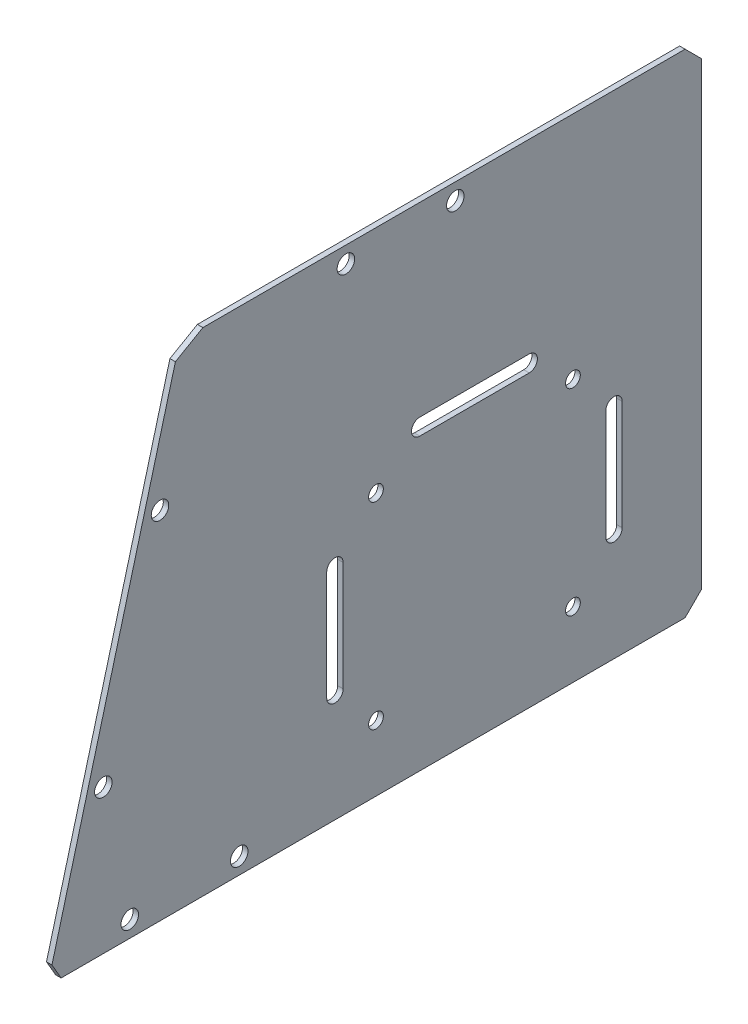
ISO-10303-21;
HEADER;
FILE_DESCRIPTION(('STEP AP214'),'2;1');
FILE_NAME('part.step','',(''),(''),'','','');
FILE_SCHEMA(('AUTOMOTIVE_DESIGN { 1 0 10303 214 1 1 1 1 }'));
ENDSEC;
DATA;
#1=APPLICATION_CONTEXT('core data for automotive mechanical design processes');
#2=APPLICATION_PROTOCOL_DEFINITION('international standard','automotive_design',2000,#1);
#3=PRODUCT_CONTEXT('',#1,'mechanical');
#4=PRODUCT('Part','Part','',(#3));
#5=PRODUCT_RELATED_PRODUCT_CATEGORY('part','',(#4));
#6=PRODUCT_DEFINITION_FORMATION('','',#4);
#7=PRODUCT_DEFINITION_CONTEXT('part definition',#1,'design');
#8=PRODUCT_DEFINITION('design','',#6,#7);
#9=PRODUCT_DEFINITION_SHAPE('','',#8);
#10=(LENGTH_UNIT() NAMED_UNIT(*) SI_UNIT(.MILLI.,.METRE.));
#11=(NAMED_UNIT(*) PLANE_ANGLE_UNIT() SI_UNIT($,.RADIAN.));
#12=(NAMED_UNIT(*) SI_UNIT($,.STERADIAN.) SOLID_ANGLE_UNIT());
#13=UNCERTAINTY_MEASURE_WITH_UNIT(LENGTH_MEASURE(1.E-05),#10,'distance_accuracy_value','');
#14=(GEOMETRIC_REPRESENTATION_CONTEXT(3) GLOBAL_UNCERTAINTY_ASSIGNED_CONTEXT((#13)) GLOBAL_UNIT_ASSIGNED_CONTEXT((#10,
#11,#12)) REPRESENTATION_CONTEXT('',''));
#15=CARTESIAN_POINT('',(0.,0.,0.));
#16=DIRECTION('',(0.,0.,1.));
#17=DIRECTION('',(1.,0.,0.));
#18=AXIS2_PLACEMENT_3D('',#15,#16,#17);
#19=CARTESIAN_POINT('',(1.,0.,0.));
#20=DIRECTION('',(1.,0.,0.));
#21=DIRECTION('',(0.,0.,-1.));
#22=AXIS2_PLACEMENT_3D('',#19,#20,#21);
#23=PLANE('',#22);
#24=CARTESIAN_POINT('',(1.,62.,18.5));
#25=DIRECTION('',(1.,0.,0.));
#26=DIRECTION('',(0.,0.,-1.));
#27=AXIS2_PLACEMENT_3D('',#24,#25,#26);
#28=CIRCLE('',#27,1.5);
#29=CARTESIAN_POINT('',(1.,63.5,18.5));
#30=VERTEX_POINT('',#29);
#31=CARTESIAN_POINT('',(1.,60.5,18.5));
#32=VERTEX_POINT('',#31);
#33=EDGE_CURVE('E186',#30,#32,#28,.T.);
#34=ORIENTED_EDGE('',*,*,#33,.F.);
#35=DIRECTION('',(0.,0.,1.));
#36=VECTOR('',#35,1.);
#37=CARTESIAN_POINT('',(1.,63.5,18.5));
#38=LINE('',#37,#36);
#39=CARTESIAN_POINT('',(1.,63.5,-1.49999999999998));
#40=VERTEX_POINT('',#39);
#41=EDGE_CURVE('E204',#40,#30,#38,.T.);
#42=ORIENTED_EDGE('',*,*,#41,.F.);
#43=CARTESIAN_POINT('',(1.,62.,-1.49999999999998));
#44=DIRECTION('',(1.,0.,0.));
#45=DIRECTION('',(0.,0.,-1.));
#46=AXIS2_PLACEMENT_3D('',#43,#44,#45);
#47=CIRCLE('',#46,1.5);
#48=CARTESIAN_POINT('',(1.,60.5,-1.49999999999998));
#49=VERTEX_POINT('',#48);
#50=EDGE_CURVE('E207',#49,#40,#47,.T.);
#51=ORIENTED_EDGE('',*,*,#50,.F.);
#52=DIRECTION('',(0.,0.,-1.));
#53=VECTOR('',#52,1.);
#54=CARTESIAN_POINT('',(1.,60.5,18.5));
#55=LINE('',#54,#53);
#56=EDGE_CURVE('E213',#32,#49,#55,.T.);
#57=ORIENTED_EDGE('',*,*,#56,.F.);
#58=EDGE_LOOP('',(#34,#42,#51,#57));
#59=FACE_BOUND('',#58,.T.);
#60=CARTESIAN_POINT('',(1.,47.5,34.));
#61=DIRECTION('',(1.,0.,0.));
#62=DIRECTION('',(0.,0.,-1.));
#63=AXIS2_PLACEMENT_3D('',#60,#61,#62);
#64=CIRCLE('',#63,1.5);
#65=CARTESIAN_POINT('',(1.,47.5,32.5));
#66=VERTEX_POINT('',#65);
#67=CARTESIAN_POINT('',(1.,47.5,35.5));
#68=VERTEX_POINT('',#67);
#69=EDGE_CURVE('E238',#66,#68,#64,.T.);
#70=ORIENTED_EDGE('',*,*,#69,.F.);
#71=DIRECTION('',(0.,1.,0.));
#72=VECTOR('',#71,1.);
#73=CARTESIAN_POINT('',(1.,47.5,32.5));
#74=LINE('',#73,#72);
#75=CARTESIAN_POINT('',(1.,27.5,32.5));
#76=VERTEX_POINT('',#75);
#77=EDGE_CURVE('E228',#76,#66,#74,.T.);
#78=ORIENTED_EDGE('',*,*,#77,.F.);
#79=CARTESIAN_POINT('',(1.,27.5,34.));
#80=DIRECTION('',(1.,0.,0.));
#81=DIRECTION('',(0.,0.,-1.));
#82=AXIS2_PLACEMENT_3D('',#79,#80,#81);
#83=CIRCLE('',#82,1.5);
#84=CARTESIAN_POINT('',(1.,27.5,35.5));
#85=VERTEX_POINT('',#84);
#86=EDGE_CURVE('E244',#85,#76,#83,.T.);
#87=ORIENTED_EDGE('',*,*,#86,.F.);
#88=DIRECTION('',(0.,-1.,0.));
#89=VECTOR('',#88,1.);
#90=CARTESIAN_POINT('',(1.,47.5,35.5));
#91=LINE('',#90,#89);
#92=EDGE_CURVE('E240',#68,#85,#91,.T.);
#93=ORIENTED_EDGE('',*,*,#92,.F.);
#94=EDGE_LOOP('',(#70,#78,#87,#93));
#95=FACE_BOUND('',#94,.T.);
#96=CARTESIAN_POINT('',(1.,47.5,-17.));
#97=DIRECTION('',(1.,0.,0.));
#98=DIRECTION('',(0.,0.,1.));
#99=AXIS2_PLACEMENT_3D('',#96,#97,#98);
#100=CIRCLE('',#99,1.5);
#101=CARTESIAN_POINT('',(1.,47.5,-18.5));
#102=VERTEX_POINT('',#101);
#103=CARTESIAN_POINT('',(1.,47.5,-15.5));
#104=VERTEX_POINT('',#103);
#105=EDGE_CURVE('E270',#102,#104,#100,.T.);
#106=ORIENTED_EDGE('',*,*,#105,.F.);
#107=DIRECTION('',(0.,1.,0.));
#108=VECTOR('',#107,1.);
#109=CARTESIAN_POINT('',(1.,47.5,-18.5));
#110=LINE('',#109,#108);
#111=CARTESIAN_POINT('',(1.,27.5,-18.5));
#112=VERTEX_POINT('',#111);
#113=EDGE_CURVE('E260',#112,#102,#110,.T.);
#114=ORIENTED_EDGE('',*,*,#113,.F.);
#115=CARTESIAN_POINT('',(1.,27.5,-17.));
#116=DIRECTION('',(1.,0.,0.));
#117=DIRECTION('',(0.,0.,1.));
#118=AXIS2_PLACEMENT_3D('',#115,#116,#117);
#119=CIRCLE('',#118,1.5);
#120=CARTESIAN_POINT('',(1.,27.5,-15.5));
#121=VERTEX_POINT('',#120);
#122=EDGE_CURVE('E275',#121,#112,#119,.T.);
#123=ORIENTED_EDGE('',*,*,#122,.F.);
#124=DIRECTION('',(0.,-1.,0.));
#125=VECTOR('',#124,1.);
#126=CARTESIAN_POINT('',(1.,47.5,-15.5));
#127=LINE('',#126,#125);
#128=EDGE_CURVE('E272',#104,#121,#127,.T.);
#129=ORIENTED_EDGE('',*,*,#128,.F.);
#130=EDGE_LOOP('',(#106,#114,#123,#129));
#131=FACE_BOUND('',#130,.T.);
#132=DIRECTION('',(0.,0.,-1.));
#133=VECTOR('',#132,1.);
#134=CARTESIAN_POINT('',(1.,7.5,-48.));
#135=LINE('',#134,#133);
#136=CARTESIAN_POINT('',(1.,7.5,84.0505102572169));
#137=VERTEX_POINT('',#136);
#138=CARTESIAN_POINT('',(1.,7.5,-30.));
#139=VERTEX_POINT('',#138);
#140=EDGE_CURVE('E363',#137,#139,#135,.T.);
#141=ORIENTED_EDGE('',*,*,#140,.T.);
#142=DIRECTION('',(0.,0.707106781186545,-0.70710678118655));
#143=VECTOR('',#142,1.);
#144=CARTESIAN_POINT('',(1.,-11.25,-11.2499999999999));
#145=LINE('',#144,#143);
#146=CARTESIAN_POINT('',(1.,10.5,-33.));
#147=VERTEX_POINT('',#146);
#148=EDGE_CURVE('E380',#139,#147,#145,.T.);
#149=ORIENTED_EDGE('',*,*,#148,.T.);
#150=DIRECTION('',(0.,-1.,0.));
#151=VECTOR('',#150,1.);
#152=CARTESIAN_POINT('',(1.,0.,-33.));
#153=LINE('',#152,#151);
#154=CARTESIAN_POINT('',(1.,94.5,-33.));
#155=VERTEX_POINT('',#154);
#156=EDGE_CURVE('E289',#155,#147,#153,.T.);
#157=ORIENTED_EDGE('',*,*,#156,.F.);
#158=DIRECTION('',(0.,0.707106781186548,0.707106781186548));
#159=VECTOR('',#158,1.);
#160=CARTESIAN_POINT('',(1.,63.75,-63.75));
#161=LINE('',#160,#159);
#162=CARTESIAN_POINT('',(1.,97.5,-30.));
#163=VERTEX_POINT('',#162);
#164=EDGE_CURVE('E378',#155,#163,#161,.T.);
#165=ORIENTED_EDGE('',*,*,#164,.T.);
#166=DIRECTION('',(0.,0.,1.));
#167=VECTOR('',#166,1.);
#168=CARTESIAN_POINT('',(1.,97.5,-48.));
#169=LINE('',#168,#167);
#170=CARTESIAN_POINT('',(1.,97.5,58.1419319940803));
#171=VERTEX_POINT('',#170);
#172=EDGE_CURVE('E356',#163,#171,#169,.T.);
#173=ORIENTED_EDGE('',*,*,#172,.T.);
#174=DIRECTION('',(0.,-0.500000000000007,0.866025403784435));
#175=VECTOR('',#174,1.);
#176=CARTESIAN_POINT('',(1.,98.30119506599,56.7542214330122));
#177=LINE('',#176,#175);
#178=CARTESIAN_POINT('',(1.,94.6022225211328,63.1610298165071));
#179=VERTEX_POINT('',#178);
#180=EDGE_CURVE('E376',#171,#179,#177,.T.);
#181=ORIENTED_EDGE('',*,*,#180,.T.);
#182=DIRECTION('',(0.,-0.96592582628907,0.258819045102515));
#183=VECTOR('',#182,1.);
#184=CARTESIAN_POINT('',(1.,7.5,86.5));
#185=LINE('',#184,#183);
#186=CARTESIAN_POINT('',(1.,10.3977774788672,85.7235428646925));
#187=VERTEX_POINT('',#186);
#188=EDGE_CURVE('E353',#179,#187,#185,.T.);
#189=ORIENTED_EDGE('',*,*,#188,.T.);
#190=DIRECTION('',(0.,-0.866025403784439,-0.499999999999999));
#191=VECTOR('',#190,1.);
#192=CARTESIAN_POINT('',(1.,-34.5199385418972,59.7902874287211));
#193=LINE('',#192,#191);
#194=EDGE_CURVE('E374',#187,#137,#193,.T.);
#195=ORIENTED_EDGE('',*,*,#194,.T.);
#196=EDGE_LOOP('',(#141,#149,#157,#165,#173,#181,#189,#195));
#197=FACE_BOUND('',#196,.T.);
#198=CARTESIAN_POINT('',(1.,19.5,26.5));
#199=DIRECTION('',(1.,0.,0.));
#200=DIRECTION('',(0.,0.,1.));
#201=AXIS2_PLACEMENT_3D('',#198,#199,#200);
#202=CIRCLE('',#201,1.35);
#203=CARTESIAN_POINT('',(1.,19.5,27.85));
#204=VERTEX_POINT('',#203);
#205=EDGE_CURVE('E292',#204,#204,#202,.T.);
#206=ORIENTED_EDGE('',*,*,#205,.F.);
#207=EDGE_LOOP('',(#206));
#208=FACE_BOUND('',#207,.T.);
#209=CARTESIAN_POINT('',(1.,19.5,-9.49999999999998));
#210=DIRECTION('',(1.,0.,0.));
#211=DIRECTION('',(0.,0.,-1.));
#212=AXIS2_PLACEMENT_3D('',#209,#210,#211);
#213=CIRCLE('',#212,1.35);
#214=CARTESIAN_POINT('',(1.,19.5,-10.85));
#215=VERTEX_POINT('',#214);
#216=EDGE_CURVE('E303',#215,#215,#213,.T.);
#217=ORIENTED_EDGE('',*,*,#216,.F.);
#218=EDGE_LOOP('',(#217));
#219=FACE_BOUND('',#218,.T.);
#220=CARTESIAN_POINT('',(1.,55.5,-9.49999999999998));
#221=DIRECTION('',(1.,0.,0.));
#222=DIRECTION('',(0.,0.,1.));
#223=AXIS2_PLACEMENT_3D('',#220,#221,#222);
#224=CIRCLE('',#223,1.35000000000001);
#225=CARTESIAN_POINT('',(1.,55.5,-8.14999999999997));
#226=VERTEX_POINT('',#225);
#227=EDGE_CURVE('E297',#226,#226,#224,.T.);
#228=ORIENTED_EDGE('',*,*,#227,.F.);
#229=EDGE_LOOP('',(#228));
#230=FACE_BOUND('',#229,.T.);
#231=CARTESIAN_POINT('',(1.,55.5,26.5));
#232=DIRECTION('',(1.,0.,0.));
#233=DIRECTION('',(0.,0.,-1.));
#234=AXIS2_PLACEMENT_3D('',#231,#232,#233);
#235=CIRCLE('',#234,1.35);
#236=CARTESIAN_POINT('',(1.,55.5,25.15));
#237=VERTEX_POINT('',#236);
#238=EDGE_CURVE('E296',#237,#237,#235,.T.);
#239=ORIENTED_EDGE('',*,*,#238,.F.);
#240=EDGE_LOOP('',(#239));
#241=FACE_BOUND('',#240,.T.);
#242=CARTESIAN_POINT('',(1.,33.8629669484372,76.3302357548478));
#243=DIRECTION('',(-1.,0.,0.));
#244=DIRECTION('',(0.,0.,1.));
#245=AXIS2_PLACEMENT_3D('',#242,#243,#244);
#246=CIRCLE('',#245,1.60000000000001);
#247=CARTESIAN_POINT('',(1.,33.8629669484372,77.9302357548478));
#248=VERTEX_POINT('',#247);
#249=EDGE_CURVE('E330',#248,#248,#246,.T.);
#250=ORIENTED_EDGE('',*,*,#249,.T.);
#251=EDGE_LOOP('',(#250));
#252=FACE_BOUND('',#251,.T.);
#253=CARTESIAN_POINT('',(1.,10.4999999999999,51.5));
#254=DIRECTION('',(-1.,0.,0.));
#255=DIRECTION('',(0.,0.,1.));
#256=AXIS2_PLACEMENT_3D('',#253,#254,#255);
#257=CIRCLE('',#256,1.6);
#258=CARTESIAN_POINT('',(1.,10.4999999999999,53.1));
#259=VERTEX_POINT('',#258);
#260=EDGE_CURVE('E331',#259,#259,#257,.T.);
#261=ORIENTED_EDGE('',*,*,#260,.T.);
#262=EDGE_LOOP('',(#261));
#263=FACE_BOUND('',#262,.T.);
#264=CARTESIAN_POINT('',(1.,94.5,12.));
#265=DIRECTION('',(-1.,0.,0.));
#266=DIRECTION('',(0.,0.,1.));
#267=AXIS2_PLACEMENT_3D('',#264,#265,#266);
#268=CIRCLE('',#267,1.60000000000001);
#269=CARTESIAN_POINT('',(1.,94.5,13.6));
#270=VERTEX_POINT('',#269);
#271=EDGE_CURVE('E338',#270,#270,#268,.T.);
#272=ORIENTED_EDGE('',*,*,#271,.T.);
#273=EDGE_LOOP('',(#272));
#274=FACE_BOUND('',#273,.T.);
#275=CARTESIAN_POINT('',(1.,94.5,32.));
#276=DIRECTION('',(-1.,0.,0.));
#277=DIRECTION('',(0.,0.,1.));
#278=AXIS2_PLACEMENT_3D('',#275,#276,#277);
#279=CIRCLE('',#278,1.60000000000001);
#280=CARTESIAN_POINT('',(1.,94.5,33.6));
#281=VERTEX_POINT('',#280);
#282=EDGE_CURVE('E317',#281,#281,#279,.T.);
#283=ORIENTED_EDGE('',*,*,#282,.T.);
#284=EDGE_LOOP('',(#283));
#285=FACE_BOUND('',#284,.T.);
#286=CARTESIAN_POINT('',(1.,72.5,65.9774739507473));
#287=DIRECTION('',(-1.,0.,0.));
#288=DIRECTION('',(0.,0.,1.));
#289=AXIS2_PLACEMENT_3D('',#286,#287,#288);
#290=CIRCLE('',#289,1.60000000000001);
#291=CARTESIAN_POINT('',(1.,72.5,67.5774739507473));
#292=VERTEX_POINT('',#291);
#293=EDGE_CURVE('E324',#292,#292,#290,.T.);
#294=ORIENTED_EDGE('',*,*,#293,.T.);
#295=EDGE_LOOP('',(#294));
#296=FACE_BOUND('',#295,.T.);
#297=CARTESIAN_POINT('',(1.,10.5,71.5));
#298=DIRECTION('',(-1.,0.,0.));
#299=DIRECTION('',(0.,0.,1.));
#300=AXIS2_PLACEMENT_3D('',#297,#298,#299);
#301=CIRCLE('',#300,1.6);
#302=CARTESIAN_POINT('',(1.,10.5,73.1));
#303=VERTEX_POINT('',#302);
#304=EDGE_CURVE('E347',#303,#303,#301,.T.);
#305=ORIENTED_EDGE('',*,*,#304,.T.);
#306=EDGE_LOOP('',(#305));
#307=FACE_BOUND('',#306,.T.);
#308=ADVANCED_FACE('F40',(#59,#95,#131,#197,#208,#219,#230,#241,#252,#263,#274,#285,#296,#307),
#23,.T.);
#309=CARTESIAN_POINT('',(0.,0.,0.));
#310=DIRECTION('',(1.,0.,0.));
#311=DIRECTION('',(0.,0.,-1.));
#312=AXIS2_PLACEMENT_3D('',#309,#310,#311);
#313=PLANE('',#312);
#314=DIRECTION('',(0.,0.,1.));
#315=VECTOR('',#314,1.);
#316=CARTESIAN_POINT('',(0.,63.5,18.5));
#317=LINE('',#316,#315);
#318=CARTESIAN_POINT('',(0.,63.5,-1.49999999999998));
#319=VERTEX_POINT('',#318);
#320=CARTESIAN_POINT('',(0.,63.5,18.5));
#321=VERTEX_POINT('',#320);
#322=EDGE_CURVE('E191',#319,#321,#317,.T.);
#323=ORIENTED_EDGE('',*,*,#322,.T.);
#324=CARTESIAN_POINT('',(0.,62.,18.5));
#325=DIRECTION('',(1.,0.,0.));
#326=DIRECTION('',(0.,0.,-1.));
#327=AXIS2_PLACEMENT_3D('',#324,#325,#326);
#328=CIRCLE('',#327,1.5);
#329=CARTESIAN_POINT('',(0.,60.5,18.5));
#330=VERTEX_POINT('',#329);
#331=EDGE_CURVE('E183',#321,#330,#328,.T.);
#332=ORIENTED_EDGE('',*,*,#331,.T.);
#333=DIRECTION('',(0.,0.,-1.));
#334=VECTOR('',#333,1.);
#335=CARTESIAN_POINT('',(0.,60.5,18.5));
#336=LINE('',#335,#334);
#337=CARTESIAN_POINT('',(0.,60.5,-1.49999999999998));
#338=VERTEX_POINT('',#337);
#339=EDGE_CURVE('E195',#330,#338,#336,.T.);
#340=ORIENTED_EDGE('',*,*,#339,.T.);
#341=CARTESIAN_POINT('',(0.,62.,-1.49999999999998));
#342=DIRECTION('',(1.,0.,0.));
#343=DIRECTION('',(0.,0.,-1.));
#344=AXIS2_PLACEMENT_3D('',#341,#342,#343);
#345=CIRCLE('',#344,1.5);
#346=EDGE_CURVE('E199',#338,#319,#345,.T.);
#347=ORIENTED_EDGE('',*,*,#346,.T.);
#348=EDGE_LOOP('',(#323,#332,#340,#347));
#349=FACE_BOUND('',#348,.T.);
#350=DIRECTION('',(0.,1.,0.));
#351=VECTOR('',#350,1.);
#352=CARTESIAN_POINT('',(0.,47.5,32.5));
#353=LINE('',#352,#351);
#354=CARTESIAN_POINT('',(0.,27.5,32.5));
#355=VERTEX_POINT('',#354);
#356=CARTESIAN_POINT('',(0.,47.5,32.5));
#357=VERTEX_POINT('',#356);
#358=EDGE_CURVE('E234',#355,#357,#353,.T.);
#359=ORIENTED_EDGE('',*,*,#358,.T.);
#360=CARTESIAN_POINT('',(0.,47.5,34.));
#361=DIRECTION('',(1.,0.,0.));
#362=DIRECTION('',(0.,0.,-1.));
#363=AXIS2_PLACEMENT_3D('',#360,#361,#362);
#364=CIRCLE('',#363,1.5);
#365=CARTESIAN_POINT('',(0.,47.5,35.5));
#366=VERTEX_POINT('',#365);
#367=EDGE_CURVE('E224',#357,#366,#364,.T.);
#368=ORIENTED_EDGE('',*,*,#367,.T.);
#369=DIRECTION('',(0.,-1.,0.));
#370=VECTOR('',#369,1.);
#371=CARTESIAN_POINT('',(0.,47.5,35.5));
#372=LINE('',#371,#370);
#373=CARTESIAN_POINT('',(0.,27.5,35.5));
#374=VERTEX_POINT('',#373);
#375=EDGE_CURVE('E227',#366,#374,#372,.T.);
#376=ORIENTED_EDGE('',*,*,#375,.T.);
#377=CARTESIAN_POINT('',(0.,27.5,34.));
#378=DIRECTION('',(1.,0.,0.));
#379=DIRECTION('',(0.,0.,-1.));
#380=AXIS2_PLACEMENT_3D('',#377,#378,#379);
#381=CIRCLE('',#380,1.5);
#382=EDGE_CURVE('E231',#374,#355,#381,.T.);
#383=ORIENTED_EDGE('',*,*,#382,.T.);
#384=EDGE_LOOP('',(#359,#368,#376,#383));
#385=FACE_BOUND('',#384,.T.);
#386=DIRECTION('',(0.,1.,0.));
#387=VECTOR('',#386,1.);
#388=CARTESIAN_POINT('',(0.,47.5,-18.5));
#389=LINE('',#388,#387);
#390=CARTESIAN_POINT('',(0.,27.5,-18.5));
#391=VERTEX_POINT('',#390);
#392=CARTESIAN_POINT('',(0.,47.5,-18.5));
#393=VERTEX_POINT('',#392);
#394=EDGE_CURVE('E266',#391,#393,#389,.T.);
#395=ORIENTED_EDGE('',*,*,#394,.T.);
#396=CARTESIAN_POINT('',(0.,47.5,-17.));
#397=DIRECTION('',(1.,0.,0.));
#398=DIRECTION('',(0.,0.,1.));
#399=AXIS2_PLACEMENT_3D('',#396,#397,#398);
#400=CIRCLE('',#399,1.5);
#401=CARTESIAN_POINT('',(0.,47.5,-15.5));
#402=VERTEX_POINT('',#401);
#403=EDGE_CURVE('E256',#393,#402,#400,.T.);
#404=ORIENTED_EDGE('',*,*,#403,.T.);
#405=DIRECTION('',(0.,-1.,0.));
#406=VECTOR('',#405,1.);
#407=CARTESIAN_POINT('',(0.,47.5,-15.5));
#408=LINE('',#407,#406);
#409=CARTESIAN_POINT('',(0.,27.5,-15.5));
#410=VERTEX_POINT('',#409);
#411=EDGE_CURVE('E259',#402,#410,#408,.T.);
#412=ORIENTED_EDGE('',*,*,#411,.T.);
#413=CARTESIAN_POINT('',(0.,27.5,-17.));
#414=DIRECTION('',(1.,0.,0.));
#415=DIRECTION('',(0.,0.,1.));
#416=AXIS2_PLACEMENT_3D('',#413,#414,#415);
#417=CIRCLE('',#416,1.5);
#418=EDGE_CURVE('E263',#410,#391,#417,.T.);
#419=ORIENTED_EDGE('',*,*,#418,.T.);
#420=EDGE_LOOP('',(#395,#404,#412,#419));
#421=FACE_BOUND('',#420,.T.);
#422=CARTESIAN_POINT('',(0.,19.5,26.5));
#423=DIRECTION('',(1.,0.,0.));
#424=DIRECTION('',(0.,0.,1.));
#425=AXIS2_PLACEMENT_3D('',#422,#423,#424);
#426=CIRCLE('',#425,1.35);
#427=CARTESIAN_POINT('',(0.,19.5,27.85));
#428=VERTEX_POINT('',#427);
#429=EDGE_CURVE('E306',#428,#428,#426,.T.);
#430=ORIENTED_EDGE('',*,*,#429,.T.);
#431=EDGE_LOOP('',(#430));
#432=FACE_BOUND('',#431,.T.);
#433=CARTESIAN_POINT('',(0.,19.5,-9.49999999999998));
#434=DIRECTION('',(1.,0.,0.));
#435=DIRECTION('',(0.,0.,-1.));
#436=AXIS2_PLACEMENT_3D('',#433,#434,#435);
#437=CIRCLE('',#436,1.35);
#438=CARTESIAN_POINT('',(0.,19.5,-10.85));
#439=VERTEX_POINT('',#438);
#440=EDGE_CURVE('E300',#439,#439,#437,.T.);
#441=ORIENTED_EDGE('',*,*,#440,.T.);
#442=EDGE_LOOP('',(#441));
#443=FACE_BOUND('',#442,.T.);
#444=CARTESIAN_POINT('',(0.,55.5,-9.49999999999998));
#445=DIRECTION('',(1.,0.,0.));
#446=DIRECTION('',(0.,0.,1.));
#447=AXIS2_PLACEMENT_3D('',#444,#445,#446);
#448=CIRCLE('',#447,1.35000000000001);
#449=CARTESIAN_POINT('',(0.,55.5,-8.14999999999997));
#450=VERTEX_POINT('',#449);
#451=EDGE_CURVE('E293',#450,#450,#448,.T.);
#452=ORIENTED_EDGE('',*,*,#451,.T.);
#453=EDGE_LOOP('',(#452));
#454=FACE_BOUND('',#453,.T.);
#455=CARTESIAN_POINT('',(0.,55.5,26.5));
#456=DIRECTION('',(1.,0.,0.));
#457=DIRECTION('',(0.,0.,-1.));
#458=AXIS2_PLACEMENT_3D('',#455,#456,#457);
#459=CIRCLE('',#458,1.35);
#460=CARTESIAN_POINT('',(0.,55.5,25.15));
#461=VERTEX_POINT('',#460);
#462=EDGE_CURVE('E311',#461,#461,#459,.T.);
#463=ORIENTED_EDGE('',*,*,#462,.T.);
#464=EDGE_LOOP('',(#463));
#465=FACE_BOUND('',#464,.T.);
#466=CARTESIAN_POINT('',(0.,33.8629669484372,76.3302357548478));
#467=DIRECTION('',(-1.,0.,0.));
#468=DIRECTION('',(0.,0.,1.));
#469=AXIS2_PLACEMENT_3D('',#466,#467,#468);
#470=CIRCLE('',#469,1.60000000000001);
#471=CARTESIAN_POINT('',(0.,33.8629669484372,77.9302357548478));
#472=VERTEX_POINT('',#471);
#473=EDGE_CURVE('E314',#472,#472,#470,.T.);
#474=ORIENTED_EDGE('',*,*,#473,.F.);
#475=EDGE_LOOP('',(#474));
#476=FACE_BOUND('',#475,.T.);
#477=CARTESIAN_POINT('',(0.,10.4999999999999,51.5));
#478=DIRECTION('',(-1.,0.,0.));
#479=DIRECTION('',(0.,0.,1.));
#480=AXIS2_PLACEMENT_3D('',#477,#478,#479);
#481=CIRCLE('',#480,1.6);
#482=CARTESIAN_POINT('',(0.,10.4999999999999,53.1));
#483=VERTEX_POINT('',#482);
#484=EDGE_CURVE('E335',#483,#483,#481,.T.);
#485=ORIENTED_EDGE('',*,*,#484,.F.);
#486=EDGE_LOOP('',(#485));
#487=FACE_BOUND('',#486,.T.);
#488=CARTESIAN_POINT('',(0.,94.5,12.));
#489=DIRECTION('',(-1.,0.,0.));
#490=DIRECTION('',(0.,0.,1.));
#491=AXIS2_PLACEMENT_3D('',#488,#489,#490);
#492=CIRCLE('',#491,1.60000000000001);
#493=CARTESIAN_POINT('',(0.,94.5,13.6));
#494=VERTEX_POINT('',#493);
#495=EDGE_CURVE('E320',#494,#494,#492,.T.);
#496=ORIENTED_EDGE('',*,*,#495,.F.);
#497=EDGE_LOOP('',(#496));
#498=FACE_BOUND('',#497,.T.);
#499=CARTESIAN_POINT('',(0.,94.5,32.));
#500=DIRECTION('',(-1.,0.,0.));
#501=DIRECTION('',(0.,0.,1.));
#502=AXIS2_PLACEMENT_3D('',#499,#500,#501);
#503=CIRCLE('',#502,1.60000000000001);
#504=CARTESIAN_POINT('',(0.,94.5,33.6));
#505=VERTEX_POINT('',#504);
#506=EDGE_CURVE('E321',#505,#505,#503,.T.);
#507=ORIENTED_EDGE('',*,*,#506,.F.);
#508=EDGE_LOOP('',(#507));
#509=FACE_BOUND('',#508,.T.);
#510=CARTESIAN_POINT('',(0.,72.5,65.9774739507473));
#511=DIRECTION('',(-1.,0.,0.));
#512=DIRECTION('',(0.,0.,1.));
#513=AXIS2_PLACEMENT_3D('',#510,#511,#512);
#514=CIRCLE('',#513,1.60000000000001);
#515=CARTESIAN_POINT('',(0.,72.5,67.5774739507473));
#516=VERTEX_POINT('',#515);
#517=EDGE_CURVE('E327',#516,#516,#514,.T.);
#518=ORIENTED_EDGE('',*,*,#517,.F.);
#519=EDGE_LOOP('',(#518));
#520=FACE_BOUND('',#519,.T.);
#521=CARTESIAN_POINT('',(0.,10.5,71.5));
#522=DIRECTION('',(-1.,0.,0.));
#523=DIRECTION('',(0.,0.,1.));
#524=AXIS2_PLACEMENT_3D('',#521,#522,#523);
#525=CIRCLE('',#524,1.6);
#526=CARTESIAN_POINT('',(0.,10.5,73.1));
#527=VERTEX_POINT('',#526);
#528=EDGE_CURVE('E334',#527,#527,#525,.T.);
#529=ORIENTED_EDGE('',*,*,#528,.F.);
#530=EDGE_LOOP('',(#529));
#531=FACE_BOUND('',#530,.T.);
#532=DIRECTION('',(0.,-1.,0.));
#533=VECTOR('',#532,1.);
#534=CARTESIAN_POINT('',(0.,97.5,-33.));
#535=LINE('',#534,#533);
#536=CARTESIAN_POINT('',(0.,94.5,-33.));
#537=VERTEX_POINT('',#536);
#538=CARTESIAN_POINT('',(0.,10.5,-33.));
#539=VERTEX_POINT('',#538);
#540=EDGE_CURVE('E220',#537,#539,#535,.T.);
#541=ORIENTED_EDGE('',*,*,#540,.T.);
#542=DIRECTION('',(0.,-0.707106781186545,0.70710678118655));
#543=VECTOR('',#542,1.);
#544=CARTESIAN_POINT('',(0.,7.5,-30.));
#545=LINE('',#544,#543);
#546=CARTESIAN_POINT('',(0.,7.5,-30.));
#547=VERTEX_POINT('',#546);
#548=EDGE_CURVE('E392',#539,#547,#545,.T.);
#549=ORIENTED_EDGE('',*,*,#548,.T.);
#550=DIRECTION('',(0.,0.,1.));
#551=VECTOR('',#550,1.);
#552=CARTESIAN_POINT('',(0.,7.5,-48.));
#553=LINE('',#552,#551);
#554=CARTESIAN_POINT('',(0.,7.5,84.0505102572169));
#555=VERTEX_POINT('',#554);
#556=EDGE_CURVE('E359',#547,#555,#553,.T.);
#557=ORIENTED_EDGE('',*,*,#556,.T.);
#558=DIRECTION('',(0.,0.866025403784439,0.499999999999999));
#559=VECTOR('',#558,1.);
#560=CARTESIAN_POINT('',(0.,10.3977774788672,85.7235428646925));
#561=LINE('',#560,#559);
#562=CARTESIAN_POINT('',(0.,10.3977774788672,85.7235428646925));
#563=VERTEX_POINT('',#562);
#564=EDGE_CURVE('E387',#555,#563,#561,.T.);
#565=ORIENTED_EDGE('',*,*,#564,.T.);
#566=DIRECTION('',(0.,-0.96592582628907,0.258819045102515));
#567=VECTOR('',#566,1.);
#568=CARTESIAN_POINT('',(0.,7.5,86.5));
#569=LINE('',#568,#567);
#570=CARTESIAN_POINT('',(0.,94.6022225211328,63.1610298165071));
#571=VERTEX_POINT('',#570);
#572=EDGE_CURVE('E350',#571,#563,#569,.T.);
#573=ORIENTED_EDGE('',*,*,#572,.F.);
#574=DIRECTION('',(0.,0.500000000000007,-0.866025403784435));
#575=VECTOR('',#574,1.);
#576=CARTESIAN_POINT('',(0.,94.6022225211328,63.1610298165071));
#577=LINE('',#576,#575);
#578=CARTESIAN_POINT('',(0.,97.5,58.1419319940803));
#579=VERTEX_POINT('',#578);
#580=EDGE_CURVE('E63',#571,#579,#577,.T.);
#581=ORIENTED_EDGE('',*,*,#580,.T.);
#582=DIRECTION('',(0.,0.,-1.));
#583=VECTOR('',#582,1.);
#584=CARTESIAN_POINT('',(0.,97.5,-48.));
#585=LINE('',#584,#583);
#586=CARTESIAN_POINT('',(0.,97.5,-30.));
#587=VERTEX_POINT('',#586);
#588=EDGE_CURVE('E362',#579,#587,#585,.T.);
#589=ORIENTED_EDGE('',*,*,#588,.T.);
#590=DIRECTION('',(0.,-0.707106781186548,-0.707106781186548));
#591=VECTOR('',#590,1.);
#592=CARTESIAN_POINT('',(0.,94.5,-33.));
#593=LINE('',#592,#591);
#594=EDGE_CURVE('E390',#587,#537,#593,.T.);
#595=ORIENTED_EDGE('',*,*,#594,.T.);
#596=EDGE_LOOP('',(#541,#549,#557,#565,#573,#581,#589,#595));
#597=FACE_BOUND('',#596,.T.);
#598=ADVANCED_FACE('F201',(#349,#385,#421,#432,#443,#454,#465,#476,#487,#498,#509,#520,#531,
#597),#313,.F.);
#599=CARTESIAN_POINT('',(-161.834019909289,7.5,-48.));
#600=DIRECTION('',(0.,-1.,0.));
#601=DIRECTION('',(0.,0.,-1.));
#602=AXIS2_PLACEMENT_3D('',#599,#600,#601);
#603=PLANE('',#602);
#604=ORIENTED_EDGE('',*,*,#556,.F.);
#605=DIRECTION('',(1.,0.,0.));
#606=VECTOR('',#605,1.);
#607=CARTESIAN_POINT('',(1.,7.5,-30.));
#608=LINE('',#607,#606);
#609=EDGE_CURVE('E371',#547,#139,#608,.T.);
#610=ORIENTED_EDGE('',*,*,#609,.T.);
#611=ORIENTED_EDGE('',*,*,#140,.F.);
#612=DIRECTION('',(-1.,0.,0.));
#613=VECTOR('',#612,1.);
#614=CARTESIAN_POINT('',(0.,7.5,84.0505102572169));
#615=LINE('',#614,#613);
#616=EDGE_CURVE('E369',#137,#555,#615,.T.);
#617=ORIENTED_EDGE('',*,*,#616,.T.);
#618=EDGE_LOOP('',(#604,#610,#611,#617));
#619=FACE_BOUND('',#618,.T.);
#620=ADVANCED_FACE('F414',(#619),#603,.T.);
#621=CARTESIAN_POINT('',(-161.834019909289,97.5,-48.));
#622=DIRECTION('',(0.,1.,0.));
#623=DIRECTION('',(0.,0.,1.));
#624=AXIS2_PLACEMENT_3D('',#621,#622,#623);
#625=PLANE('',#624);
#626=ORIENTED_EDGE('',*,*,#172,.F.);
#627=DIRECTION('',(-1.,0.,0.));
#628=VECTOR('',#627,1.);
#629=CARTESIAN_POINT('',(0.,97.5,-30.));
#630=LINE('',#629,#628);
#631=EDGE_CURVE('E56',#163,#587,#630,.T.);
#632=ORIENTED_EDGE('',*,*,#631,.T.);
#633=ORIENTED_EDGE('',*,*,#588,.F.);
#634=DIRECTION('',(1.,0.,0.));
#635=VECTOR('',#634,1.);
#636=CARTESIAN_POINT('',(1.,97.5,58.1419319940803));
#637=LINE('',#636,#635);
#638=EDGE_CURVE('E394',#579,#171,#637,.T.);
#639=ORIENTED_EDGE('',*,*,#638,.T.);
#640=EDGE_LOOP('',(#626,#632,#633,#639));
#641=FACE_BOUND('',#640,.T.);
#642=ADVANCED_FACE('F428',(#641),#625,.T.);
#643=CARTESIAN_POINT('',(1.,7.5,86.5));
#644=DIRECTION('',(0.,-0.258819045102515,-0.96592582628907));
#645=DIRECTION('',(0.,0.96592582628907,-0.258819045102515));
#646=AXIS2_PLACEMENT_3D('',#643,#644,#645);
#647=PLANE('',#646);
#648=ORIENTED_EDGE('',*,*,#188,.F.);
#649=DIRECTION('',(-1.,0.,0.));
#650=VECTOR('',#649,1.);
#651=CARTESIAN_POINT('',(0.,94.6022225211328,63.1610298165071));
#652=LINE('',#651,#650);
#653=EDGE_CURVE('E11',#179,#571,#652,.T.);
#654=ORIENTED_EDGE('',*,*,#653,.T.);
#655=ORIENTED_EDGE('',*,*,#572,.T.);
#656=DIRECTION('',(1.,0.,0.));
#657=VECTOR('',#656,1.);
#658=CARTESIAN_POINT('',(1.,10.3977774788672,85.7235428646925));
#659=LINE('',#658,#657);
#660=EDGE_CURVE('E49',#563,#187,#659,.T.);
#661=ORIENTED_EDGE('',*,*,#660,.T.);
#662=EDGE_LOOP('',(#648,#654,#655,#661));
#663=FACE_BOUND('',#662,.T.);
#664=ADVANCED_FACE('F400',(#663),#647,.F.);
#665=CARTESIAN_POINT('',(1.,10.5,71.5));
#666=DIRECTION('',(-1.,0.,0.));
#667=DIRECTION('',(0.,0.,1.));
#668=AXIS2_PLACEMENT_3D('',#665,#666,#667);
#669=CYLINDRICAL_SURFACE('',#668,1.6);
#670=ORIENTED_EDGE('',*,*,#304,.F.);
#671=EDGE_LOOP('',(#670));
#672=FACE_BOUND('',#671,.T.);
#673=ORIENTED_EDGE('',*,*,#528,.T.);
#674=EDGE_LOOP('',(#673));
#675=FACE_BOUND('',#674,.T.);
#676=ADVANCED_FACE('F435',(#672,#675),#669,.F.);
#677=CARTESIAN_POINT('',(1.,72.5,65.9774739507473));
#678=DIRECTION('',(-1.,0.,0.));
#679=DIRECTION('',(0.,0.,1.));
#680=AXIS2_PLACEMENT_3D('',#677,#678,#679);
#681=CYLINDRICAL_SURFACE('',#680,1.60000000000001);
#682=ORIENTED_EDGE('',*,*,#293,.F.);
#683=EDGE_LOOP('',(#682));
#684=FACE_BOUND('',#683,.T.);
#685=ORIENTED_EDGE('',*,*,#517,.T.);
#686=EDGE_LOOP('',(#685));
#687=FACE_BOUND('',#686,.T.);
#688=ADVANCED_FACE('F717',(#684,#687),#681,.F.);
#689=CARTESIAN_POINT('',(1.,94.5,32.));
#690=DIRECTION('',(-1.,0.,0.));
#691=DIRECTION('',(0.,0.,1.));
#692=AXIS2_PLACEMENT_3D('',#689,#690,#691);
#693=CYLINDRICAL_SURFACE('',#692,1.60000000000001);
#694=ORIENTED_EDGE('',*,*,#282,.F.);
#695=EDGE_LOOP('',(#694));
#696=FACE_BOUND('',#695,.T.);
#697=ORIENTED_EDGE('',*,*,#506,.T.);
#698=EDGE_LOOP('',(#697));
#699=FACE_BOUND('',#698,.T.);
#700=ADVANCED_FACE('F707',(#696,#699),#693,.F.);
#701=CARTESIAN_POINT('',(1.,94.5,12.));
#702=DIRECTION('',(-1.,0.,0.));
#703=DIRECTION('',(0.,0.,1.));
#704=AXIS2_PLACEMENT_3D('',#701,#702,#703);
#705=CYLINDRICAL_SURFACE('',#704,1.60000000000001);
#706=ORIENTED_EDGE('',*,*,#271,.F.);
#707=EDGE_LOOP('',(#706));
#708=FACE_BOUND('',#707,.T.);
#709=ORIENTED_EDGE('',*,*,#495,.T.);
#710=EDGE_LOOP('',(#709));
#711=FACE_BOUND('',#710,.T.);
#712=ADVANCED_FACE('F697',(#708,#711),#705,.F.);
#713=CARTESIAN_POINT('',(1.,10.4999999999999,51.5));
#714=DIRECTION('',(-1.,0.,0.));
#715=DIRECTION('',(0.,0.,1.));
#716=AXIS2_PLACEMENT_3D('',#713,#714,#715);
#717=CYLINDRICAL_SURFACE('',#716,1.6);
#718=ORIENTED_EDGE('',*,*,#260,.F.);
#719=EDGE_LOOP('',(#718));
#720=FACE_BOUND('',#719,.T.);
#721=ORIENTED_EDGE('',*,*,#484,.T.);
#722=EDGE_LOOP('',(#721));
#723=FACE_BOUND('',#722,.T.);
#724=ADVANCED_FACE('F687',(#720,#723),#717,.F.);
#725=CARTESIAN_POINT('',(1.,33.8629669484372,76.3302357548478));
#726=DIRECTION('',(-1.,0.,0.));
#727=DIRECTION('',(0.,0.,1.));
#728=AXIS2_PLACEMENT_3D('',#725,#726,#727);
#729=CYLINDRICAL_SURFACE('',#728,1.60000000000001);
#730=ORIENTED_EDGE('',*,*,#249,.F.);
#731=EDGE_LOOP('',(#730));
#732=FACE_BOUND('',#731,.T.);
#733=ORIENTED_EDGE('',*,*,#473,.T.);
#734=EDGE_LOOP('',(#733));
#735=FACE_BOUND('',#734,.T.);
#736=ADVANCED_FACE('F677',(#732,#735),#729,.F.);
#737=CARTESIAN_POINT('',(0.,55.5,26.5));
#738=DIRECTION('',(1.,0.,0.));
#739=DIRECTION('',(0.,0.,-1.));
#740=AXIS2_PLACEMENT_3D('',#737,#738,#739);
#741=CYLINDRICAL_SURFACE('',#740,1.35);
#742=ORIENTED_EDGE('',*,*,#462,.F.);
#743=EDGE_LOOP('',(#742));
#744=FACE_BOUND('',#743,.T.);
#745=ORIENTED_EDGE('',*,*,#238,.T.);
#746=EDGE_LOOP('',(#745));
#747=FACE_BOUND('',#746,.T.);
#748=ADVANCED_FACE('F667',(#744,#747),#741,.F.);
#749=CARTESIAN_POINT('',(0.,55.5,-9.49999999999998));
#750=DIRECTION('',(1.,0.,0.));
#751=DIRECTION('',(0.,0.,-1.));
#752=AXIS2_PLACEMENT_3D('',#749,#750,#751);
#753=CYLINDRICAL_SURFACE('',#752,1.35000000000001);
#754=ORIENTED_EDGE('',*,*,#451,.F.);
#755=EDGE_LOOP('',(#754));
#756=FACE_BOUND('',#755,.T.);
#757=ORIENTED_EDGE('',*,*,#227,.T.);
#758=EDGE_LOOP('',(#757));
#759=FACE_BOUND('',#758,.T.);
#760=ADVANCED_FACE('F657',(#756,#759),#753,.F.);
#761=CARTESIAN_POINT('',(0.,19.5,-9.49999999999998));
#762=DIRECTION('',(1.,0.,0.));
#763=DIRECTION('',(0.,0.,-1.));
#764=AXIS2_PLACEMENT_3D('',#761,#762,#763);
#765=CYLINDRICAL_SURFACE('',#764,1.35);
#766=ORIENTED_EDGE('',*,*,#440,.F.);
#767=EDGE_LOOP('',(#766));
#768=FACE_BOUND('',#767,.T.);
#769=ORIENTED_EDGE('',*,*,#216,.T.);
#770=EDGE_LOOP('',(#769));
#771=FACE_BOUND('',#770,.T.);
#772=ADVANCED_FACE('F647',(#768,#771),#765,.F.);
#773=CARTESIAN_POINT('',(0.,19.5,26.5));
#774=DIRECTION('',(1.,0.,0.));
#775=DIRECTION('',(0.,0.,-1.));
#776=AXIS2_PLACEMENT_3D('',#773,#774,#775);
#777=CYLINDRICAL_SURFACE('',#776,1.35);
#778=ORIENTED_EDGE('',*,*,#429,.F.);
#779=EDGE_LOOP('',(#778));
#780=FACE_BOUND('',#779,.T.);
#781=ORIENTED_EDGE('',*,*,#205,.T.);
#782=EDGE_LOOP('',(#781));
#783=FACE_BOUND('',#782,.T.);
#784=ADVANCED_FACE('F493',(#780,#783),#777,.F.);
#785=CARTESIAN_POINT('',(0.,97.5,-33.));
#786=DIRECTION('',(0.,0.,1.));
#787=DIRECTION('',(0.,-1.,0.));
#788=AXIS2_PLACEMENT_3D('',#785,#786,#787);
#789=PLANE('',#788);
#790=ORIENTED_EDGE('',*,*,#156,.T.);
#791=DIRECTION('',(-1.,0.,0.));
#792=VECTOR('',#791,1.);
#793=CARTESIAN_POINT('',(0.,10.5,-33.));
#794=LINE('',#793,#792);
#795=EDGE_CURVE('E385',#147,#539,#794,.T.);
#796=ORIENTED_EDGE('',*,*,#795,.T.);
#797=ORIENTED_EDGE('',*,*,#540,.F.);
#798=DIRECTION('',(1.,0.,0.));
#799=VECTOR('',#798,1.);
#800=CARTESIAN_POINT('',(1.,94.5,-33.));
#801=LINE('',#800,#799);
#802=EDGE_CURVE('E382',#537,#155,#801,.T.);
#803=ORIENTED_EDGE('',*,*,#802,.T.);
#804=EDGE_LOOP('',(#790,#796,#797,#803));
#805=FACE_BOUND('',#804,.T.);
#806=ADVANCED_FACE('F420',(#805),#789,.F.);
#807=CARTESIAN_POINT('',(0.,47.5,-17.));
#808=DIRECTION('',(1.,0.,0.));
#809=DIRECTION('',(0.,0.,-1.));
#810=AXIS2_PLACEMENT_3D('',#807,#808,#809);
#811=CYLINDRICAL_SURFACE('',#810,1.5);
#812=ORIENTED_EDGE('',*,*,#105,.T.);
#813=DIRECTION('',(1.,0.,0.));
#814=VECTOR('',#813,1.);
#815=CARTESIAN_POINT('',(0.,47.5,-15.5));
#816=LINE('',#815,#814);
#817=EDGE_CURVE('E269',#402,#104,#816,.T.);
#818=ORIENTED_EDGE('',*,*,#817,.F.);
#819=ORIENTED_EDGE('',*,*,#403,.F.);
#820=DIRECTION('',(1.,0.,0.));
#821=VECTOR('',#820,1.);
#822=CARTESIAN_POINT('',(0.,47.5,-18.5));
#823=LINE('',#822,#821);
#824=EDGE_CURVE('E241',#393,#102,#823,.T.);
#825=ORIENTED_EDGE('',*,*,#824,.T.);
#826=EDGE_LOOP('',(#812,#818,#819,#825));
#827=FACE_BOUND('',#826,.T.);
#828=ADVANCED_FACE('F492',(#827),#811,.F.);
#829=CARTESIAN_POINT('',(0.,47.5,-18.5));
#830=DIRECTION('',(0.,0.,-1.));
#831=DIRECTION('',(-1.,0.,0.));
#832=AXIS2_PLACEMENT_3D('',#829,#830,#831);
#833=PLANE('',#832);
#834=ORIENTED_EDGE('',*,*,#113,.T.);
#835=ORIENTED_EDGE('',*,*,#824,.F.);
#836=ORIENTED_EDGE('',*,*,#394,.F.);
#837=DIRECTION('',(1.,0.,0.));
#838=VECTOR('',#837,1.);
#839=CARTESIAN_POINT('',(0.,27.5,-18.5));
#840=LINE('',#839,#838);
#841=EDGE_CURVE('E281',#391,#112,#840,.T.);
#842=ORIENTED_EDGE('',*,*,#841,.T.);
#843=EDGE_LOOP('',(#834,#835,#836,#842));
#844=FACE_BOUND('',#843,.T.);
#845=ADVANCED_FACE('F623',(#844),#833,.F.);
#846=CARTESIAN_POINT('',(0.,27.5,-17.));
#847=DIRECTION('',(1.,0.,0.));
#848=DIRECTION('',(0.,0.,-1.));
#849=AXIS2_PLACEMENT_3D('',#846,#847,#848);
#850=CYLINDRICAL_SURFACE('',#849,1.5);
#851=ORIENTED_EDGE('',*,*,#122,.T.);
#852=ORIENTED_EDGE('',*,*,#841,.F.);
#853=ORIENTED_EDGE('',*,*,#418,.F.);
#854=DIRECTION('',(1.,0.,0.));
#855=VECTOR('',#854,1.);
#856=CARTESIAN_POINT('',(0.,27.5,-15.5));
#857=LINE('',#856,#855);
#858=EDGE_CURVE('E283',#410,#121,#857,.T.);
#859=ORIENTED_EDGE('',*,*,#858,.T.);
#860=EDGE_LOOP('',(#851,#852,#853,#859));
#861=FACE_BOUND('',#860,.T.);
#862=ADVANCED_FACE('F613',(#861),#850,.F.);
#863=CARTESIAN_POINT('',(0.,47.5,-15.5));
#864=DIRECTION('',(0.,0.,1.));
#865=DIRECTION('',(1.,0.,0.));
#866=AXIS2_PLACEMENT_3D('',#863,#864,#865);
#867=PLANE('',#866);
#868=ORIENTED_EDGE('',*,*,#128,.T.);
#869=ORIENTED_EDGE('',*,*,#858,.F.);
#870=ORIENTED_EDGE('',*,*,#411,.F.);
#871=ORIENTED_EDGE('',*,*,#817,.T.);
#872=EDGE_LOOP('',(#868,#869,#870,#871));
#873=FACE_BOUND('',#872,.T.);
#874=ADVANCED_FACE('F603',(#873),#867,.F.);
#875=CARTESIAN_POINT('',(0.,47.5,34.));
#876=DIRECTION('',(1.,0.,0.));
#877=DIRECTION('',(0.,0.,-1.));
#878=AXIS2_PLACEMENT_3D('',#875,#876,#877);
#879=CYLINDRICAL_SURFACE('',#878,1.5);
#880=ORIENTED_EDGE('',*,*,#69,.T.);
#881=DIRECTION('',(1.,0.,0.));
#882=VECTOR('',#881,1.);
#883=CARTESIAN_POINT('',(0.,47.5,35.5));
#884=LINE('',#883,#882);
#885=EDGE_CURVE('E237',#366,#68,#884,.T.);
#886=ORIENTED_EDGE('',*,*,#885,.F.);
#887=ORIENTED_EDGE('',*,*,#367,.F.);
#888=DIRECTION('',(1.,0.,0.));
#889=VECTOR('',#888,1.);
#890=CARTESIAN_POINT('',(0.,47.5,32.5));
#891=LINE('',#890,#889);
#892=EDGE_CURVE('E214',#357,#66,#891,.T.);
#893=ORIENTED_EDGE('',*,*,#892,.T.);
#894=EDGE_LOOP('',(#880,#886,#887,#893));
#895=FACE_BOUND('',#894,.T.);
#896=ADVANCED_FACE('F593',(#895),#879,.F.);
#897=CARTESIAN_POINT('',(0.,47.5,32.5));
#898=DIRECTION('',(0.,0.,-1.));
#899=DIRECTION('',(-1.,0.,0.));
#900=AXIS2_PLACEMENT_3D('',#897,#898,#899);
#901=PLANE('',#900);
#902=ORIENTED_EDGE('',*,*,#77,.T.);
#903=ORIENTED_EDGE('',*,*,#892,.F.);
#904=ORIENTED_EDGE('',*,*,#358,.F.);
#905=DIRECTION('',(1.,0.,0.));
#906=VECTOR('',#905,1.);
#907=CARTESIAN_POINT('',(0.,27.5,32.5));
#908=LINE('',#907,#906);
#909=EDGE_CURVE('E250',#355,#76,#908,.T.);
#910=ORIENTED_EDGE('',*,*,#909,.T.);
#911=EDGE_LOOP('',(#902,#903,#904,#910));
#912=FACE_BOUND('',#911,.T.);
#913=ADVANCED_FACE('F583',(#912),#901,.F.);
#914=CARTESIAN_POINT('',(0.,27.5,34.));
#915=DIRECTION('',(1.,0.,0.));
#916=DIRECTION('',(0.,0.,-1.));
#917=AXIS2_PLACEMENT_3D('',#914,#915,#916);
#918=CYLINDRICAL_SURFACE('',#917,1.5);
#919=ORIENTED_EDGE('',*,*,#86,.T.);
#920=ORIENTED_EDGE('',*,*,#909,.F.);
#921=ORIENTED_EDGE('',*,*,#382,.F.);
#922=DIRECTION('',(1.,0.,0.));
#923=VECTOR('',#922,1.);
#924=CARTESIAN_POINT('',(0.,27.5,35.5));
#925=LINE('',#924,#923);
#926=EDGE_CURVE('E252',#374,#85,#925,.T.);
#927=ORIENTED_EDGE('',*,*,#926,.T.);
#928=EDGE_LOOP('',(#919,#920,#921,#927));
#929=FACE_BOUND('',#928,.T.);
#930=ADVANCED_FACE('F573',(#929),#918,.F.);
#931=CARTESIAN_POINT('',(0.,47.5,35.5));
#932=DIRECTION('',(0.,0.,1.));
#933=DIRECTION('',(1.,0.,0.));
#934=AXIS2_PLACEMENT_3D('',#931,#932,#933);
#935=PLANE('',#934);
#936=ORIENTED_EDGE('',*,*,#92,.T.);
#937=ORIENTED_EDGE('',*,*,#926,.F.);
#938=ORIENTED_EDGE('',*,*,#375,.F.);
#939=ORIENTED_EDGE('',*,*,#885,.T.);
#940=EDGE_LOOP('',(#936,#937,#938,#939));
#941=FACE_BOUND('',#940,.T.);
#942=ADVANCED_FACE('F564',(#941),#935,.F.);
#943=CARTESIAN_POINT('',(0.,62.,18.5));
#944=DIRECTION('',(1.,0.,0.));
#945=DIRECTION('',(0.,0.,-1.));
#946=AXIS2_PLACEMENT_3D('',#943,#944,#945);
#947=CYLINDRICAL_SURFACE('',#946,1.5);
#948=ORIENTED_EDGE('',*,*,#33,.T.);
#949=DIRECTION('',(1.,0.,0.));
#950=VECTOR('',#949,1.);
#951=CARTESIAN_POINT('',(0.,60.5,18.5));
#952=LINE('',#951,#950);
#953=EDGE_CURVE('E179',#330,#32,#952,.T.);
#954=ORIENTED_EDGE('',*,*,#953,.F.);
#955=ORIENTED_EDGE('',*,*,#331,.F.);
#956=DIRECTION('',(1.,0.,0.));
#957=VECTOR('',#956,1.);
#958=CARTESIAN_POINT('',(0.,63.5,18.5));
#959=LINE('',#958,#957);
#960=EDGE_CURVE('E218',#321,#30,#959,.T.);
#961=ORIENTED_EDGE('',*,*,#960,.T.);
#962=EDGE_LOOP('',(#948,#954,#955,#961));
#963=FACE_BOUND('',#962,.T.);
#964=ADVANCED_FACE('F181',(#963),#947,.F.);
#965=CARTESIAN_POINT('',(0.,63.5,18.5));
#966=DIRECTION('',(0.,1.,0.));
#967=DIRECTION('',(0.,0.,1.));
#968=AXIS2_PLACEMENT_3D('',#965,#966,#967);
#969=PLANE('',#968);
#970=ORIENTED_EDGE('',*,*,#41,.T.);
#971=ORIENTED_EDGE('',*,*,#960,.F.);
#972=ORIENTED_EDGE('',*,*,#322,.F.);
#973=DIRECTION('',(1.,0.,0.));
#974=VECTOR('',#973,1.);
#975=CARTESIAN_POINT('',(0.,63.5,-1.49999999999998));
#976=LINE('',#975,#974);
#977=EDGE_CURVE('E221',#319,#40,#976,.T.);
#978=ORIENTED_EDGE('',*,*,#977,.T.);
#979=EDGE_LOOP('',(#970,#971,#972,#978));
#980=FACE_BOUND('',#979,.T.);
#981=ADVANCED_FACE('F545',(#980),#969,.F.);
#982=CARTESIAN_POINT('',(0.,62.,-1.49999999999998));
#983=DIRECTION('',(1.,0.,0.));
#984=DIRECTION('',(0.,0.,-1.));
#985=AXIS2_PLACEMENT_3D('',#982,#983,#984);
#986=CYLINDRICAL_SURFACE('',#985,1.5);
#987=ORIENTED_EDGE('',*,*,#50,.T.);
#988=ORIENTED_EDGE('',*,*,#977,.F.);
#989=ORIENTED_EDGE('',*,*,#346,.F.);
#990=DIRECTION('',(1.,0.,0.));
#991=VECTOR('',#990,1.);
#992=CARTESIAN_POINT('',(0.,60.5,-1.49999999999998));
#993=LINE('',#992,#991);
#994=EDGE_CURVE('E190',#338,#49,#993,.T.);
#995=ORIENTED_EDGE('',*,*,#994,.T.);
#996=EDGE_LOOP('',(#987,#988,#989,#995));
#997=FACE_BOUND('',#996,.T.);
#998=ADVANCED_FACE('F536',(#997),#986,.F.);
#999=CARTESIAN_POINT('',(0.,60.5,18.5));
#1000=DIRECTION('',(0.,-1.,0.));
#1001=DIRECTION('',(0.,0.,-1.));
#1002=AXIS2_PLACEMENT_3D('',#999,#1000,#1001);
#1003=PLANE('',#1002);
#1004=ORIENTED_EDGE('',*,*,#56,.T.);
#1005=ORIENTED_EDGE('',*,*,#994,.F.);
#1006=ORIENTED_EDGE('',*,*,#339,.F.);
#1007=ORIENTED_EDGE('',*,*,#953,.T.);
#1008=EDGE_LOOP('',(#1004,#1005,#1006,#1007));
#1009=FACE_BOUND('',#1008,.T.);
#1010=ADVANCED_FACE('F196',(#1009),#1003,.F.);
#1011=CARTESIAN_POINT('',(-161.834019909289,7.5,-30.));
#1012=DIRECTION('',(0.,-0.70710678118655,-0.707106781186545));
#1013=DIRECTION('',(-1.,0.,0.));
#1014=AXIS2_PLACEMENT_3D('',#1011,#1012,#1013);
#1015=PLANE('',#1014);
#1016=ORIENTED_EDGE('',*,*,#548,.F.);
#1017=ORIENTED_EDGE('',*,*,#795,.F.);
#1018=ORIENTED_EDGE('',*,*,#148,.F.);
#1019=ORIENTED_EDGE('',*,*,#609,.F.);
#1020=EDGE_LOOP('',(#1016,#1017,#1018,#1019));
#1021=FACE_BOUND('',#1020,.T.);
#1022=ADVANCED_FACE('F424',(#1021),#1015,.T.);
#1023=CARTESIAN_POINT('',(0.,94.5,-33.));
#1024=DIRECTION('',(0.,0.707106781186548,-0.707106781186548));
#1025=DIRECTION('',(-1.,0.,0.));
#1026=AXIS2_PLACEMENT_3D('',#1023,#1024,#1025);
#1027=PLANE('',#1026);
#1028=ORIENTED_EDGE('',*,*,#594,.F.);
#1029=ORIENTED_EDGE('',*,*,#631,.F.);
#1030=ORIENTED_EDGE('',*,*,#164,.F.);
#1031=ORIENTED_EDGE('',*,*,#802,.F.);
#1032=EDGE_LOOP('',(#1028,#1029,#1030,#1031));
#1033=FACE_BOUND('',#1032,.T.);
#1034=ADVANCED_FACE('F427',(#1033),#1027,.T.);
#1035=CARTESIAN_POINT('',(1.,94.6022225211328,63.1610298165071));
#1036=DIRECTION('',(0.,0.866025403784435,0.500000000000006));
#1037=DIRECTION('',(1.,0.,0.));
#1038=AXIS2_PLACEMENT_3D('',#1035,#1036,#1037);
#1039=PLANE('',#1038);
#1040=ORIENTED_EDGE('',*,*,#180,.F.);
#1041=ORIENTED_EDGE('',*,*,#638,.F.);
#1042=ORIENTED_EDGE('',*,*,#580,.F.);
#1043=ORIENTED_EDGE('',*,*,#653,.F.);
#1044=EDGE_LOOP('',(#1040,#1041,#1042,#1043));
#1045=FACE_BOUND('',#1044,.T.);
#1046=ADVANCED_FACE('F410',(#1045),#1039,.T.);
#1047=CARTESIAN_POINT('',(1.,10.3977774788672,85.7235428646925));
#1048=DIRECTION('',(0.,-0.499999999999999,0.866025403784439));
#1049=DIRECTION('',(-1.,0.,0.));
#1050=AXIS2_PLACEMENT_3D('',#1047,#1048,#1049);
#1051=PLANE('',#1050);
#1052=ORIENTED_EDGE('',*,*,#564,.F.);
#1053=ORIENTED_EDGE('',*,*,#616,.F.);
#1054=ORIENTED_EDGE('',*,*,#194,.F.);
#1055=ORIENTED_EDGE('',*,*,#660,.F.);
#1056=EDGE_LOOP('',(#1052,#1053,#1054,#1055));
#1057=FACE_BOUND('',#1056,.T.);
#1058=ADVANCED_FACE('F43',(#1057),#1051,.T.);
#1059=CLOSED_SHELL('',(#308,#598,#620,#642,#664,#676,#688,#700,#712,#724,#736,#748,#760,#772,
#784,#806,#828,#845,#862,#874,#896,#913,#930,#942,#964,#981,#998,#1010,#1022,#1034,#1046,#1058));
#1060=MANIFOLD_SOLID_BREP('B2',#1059);
#1061=ADVANCED_BREP_SHAPE_REPRESENTATION('',(#18,#1060),#14);
#1062=SHAPE_DEFINITION_REPRESENTATION(#9,#1061);
ENDSEC;
END-ISO-10303-21;
